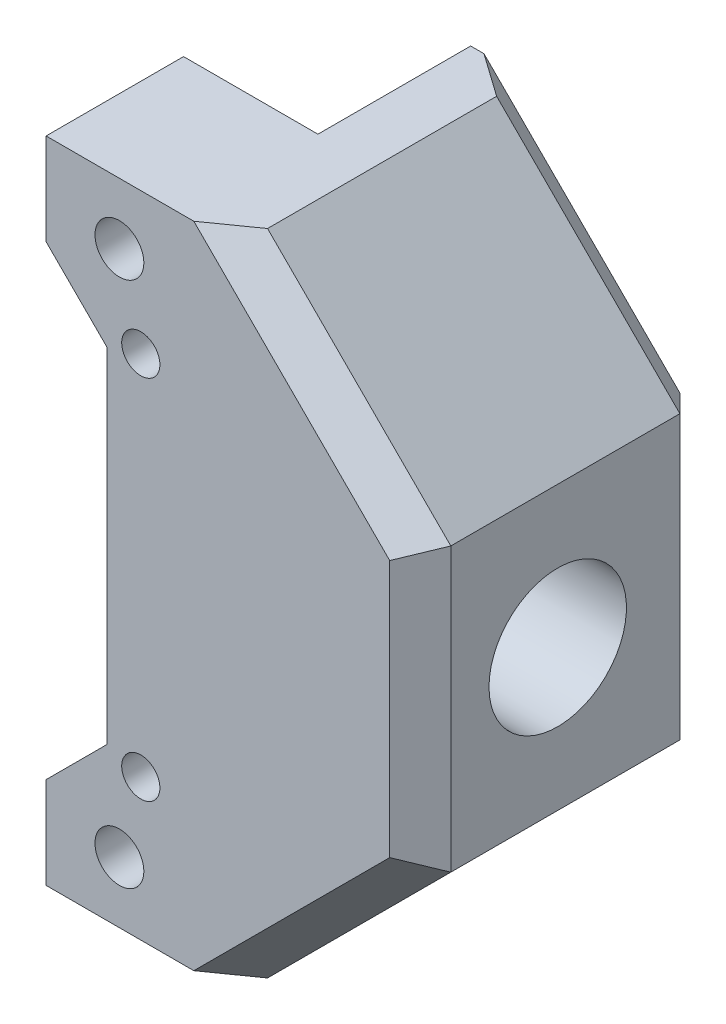
ISO-10303-21;
HEADER;
FILE_DESCRIPTION(('STEP AP214'),'2;1');
FILE_NAME('part.step','',(''),(''),'','','');
FILE_SCHEMA(('AUTOMOTIVE_DESIGN { 1 0 10303 214 1 1 1 1 }'));
ENDSEC;
DATA;
#1=APPLICATION_CONTEXT('core data for automotive mechanical design processes');
#2=APPLICATION_PROTOCOL_DEFINITION('international standard','automotive_design',2000,#1);
#3=PRODUCT_CONTEXT('',#1,'mechanical');
#4=PRODUCT('Part','Part','',(#3));
#5=PRODUCT_RELATED_PRODUCT_CATEGORY('part','',(#4));
#6=PRODUCT_DEFINITION_FORMATION('','',#4);
#7=PRODUCT_DEFINITION_CONTEXT('part definition',#1,'design');
#8=PRODUCT_DEFINITION('design','',#6,#7);
#9=PRODUCT_DEFINITION_SHAPE('','',#8);
#10=(LENGTH_UNIT() NAMED_UNIT(*) SI_UNIT(.MILLI.,.METRE.));
#11=(NAMED_UNIT(*) PLANE_ANGLE_UNIT() SI_UNIT($,.RADIAN.));
#12=(NAMED_UNIT(*) SI_UNIT($,.STERADIAN.) SOLID_ANGLE_UNIT());
#13=UNCERTAINTY_MEASURE_WITH_UNIT(LENGTH_MEASURE(1.E-05),#10,'distance_accuracy_value','');
#14=(GEOMETRIC_REPRESENTATION_CONTEXT(3) GLOBAL_UNCERTAINTY_ASSIGNED_CONTEXT((#13)) GLOBAL_UNIT_ASSIGNED_CONTEXT((#10,
#11,#12)) REPRESENTATION_CONTEXT('',''));
#15=CARTESIAN_POINT('',(0.,0.,0.));
#16=DIRECTION('',(0.,0.,1.));
#17=DIRECTION('',(1.,0.,0.));
#18=AXIS2_PLACEMENT_3D('',#15,#16,#17);
#19=CARTESIAN_POINT('',(38.6154898408302,42.4999999999995,-55.3071738249065));
#20=DIRECTION('',(-1.,0.,0.));
#21=DIRECTION('',(0.,0.,1.));
#22=AXIS2_PLACEMENT_3D('',#19,#20,#21);
#23=PLANE('',#22);
#24=DIRECTION('',(0.,0.,1.));
#25=VECTOR('',#24,1.);
#26=CARTESIAN_POINT('',(38.6154898408302,13.2499999999995,0.));
#27=LINE('',#26,#25);
#28=CARTESIAN_POINT('',(38.6154898408302,13.2499999999995,-10.0000000000035));
#29=VERTEX_POINT('',#28);
#30=CARTESIAN_POINT('',(38.6154898408302,13.2499999999995,0.));
#31=VERTEX_POINT('',#30);
#32=EDGE_CURVE('E256',#29,#31,#27,.T.);
#33=ORIENTED_EDGE('',*,*,#32,.F.);
#34=DIRECTION('',(0.,-1.,0.));
#35=VECTOR('',#34,1.);
#36=CARTESIAN_POINT('',(38.6154898408302,42.4999999999996,-10.0000000000036));
#37=LINE('',#36,#35);
#38=CARTESIAN_POINT('',(38.6154898408302,-5.12577385566101E-13,-10.0000000000035));
#39=VERTEX_POINT('',#38);
#40=EDGE_CURVE('E313',#29,#39,#37,.T.);
#41=ORIENTED_EDGE('',*,*,#40,.T.);
#42=DIRECTION('',(0.,0.,1.));
#43=VECTOR('',#42,1.);
#44=CARTESIAN_POINT('',(38.6154898408302,-5.12577385566101E-13,-55.3071738249065));
#45=LINE('',#44,#43);
#46=CARTESIAN_POINT('',(38.6154898408302,-5.12577385566101E-13,0.));
#47=VERTEX_POINT('',#46);
#48=EDGE_CURVE('E312',#39,#47,#45,.T.);
#49=ORIENTED_EDGE('',*,*,#48,.T.);
#50=DIRECTION('',(0.,1.,0.));
#51=VECTOR('',#50,1.);
#52=CARTESIAN_POINT('',(38.6154898408302,27.2499999999995,0.));
#53=LINE('',#52,#51);
#54=EDGE_CURVE('E382',#47,#31,#53,.T.);
#55=ORIENTED_EDGE('',*,*,#54,.T.);
#56=EDGE_LOOP('',(#33,#41,#49,#55));
#57=FACE_BOUND('',#56,.T.);
#58=ADVANCED_FACE('F39',(#57),#23,.T.);
#59=CARTESIAN_POINT('',(0.,0.,0.));
#60=DIRECTION('',(0.,0.,1.));
#61=DIRECTION('',(1.,0.,0.));
#62=AXIS2_PLACEMENT_3D('',#59,#60,#61);
#63=PLANE('',#62);
#64=CARTESIAN_POINT('',(36.0154898408301,33.2499999999995,0.));
#65=DIRECTION('',(0.,0.,1.));
#66=DIRECTION('',(1.,0.,0.));
#67=AXIS2_PLACEMENT_3D('',#64,#65,#66);
#68=CIRCLE('',#67,1.24999999999999);
#69=CARTESIAN_POINT('',(37.2654898408301,33.2499999999995,0.));
#70=VERTEX_POINT('',#69);
#71=EDGE_CURVE('E926',#70,#70,#68,.T.);
#72=ORIENTED_EDGE('',*,*,#71,.T.);
#73=EDGE_LOOP('',(#72));
#74=FACE_BOUND('',#73,.T.);
#75=CARTESIAN_POINT('',(34.6154898408302,38.4999999999995,0.));
#76=DIRECTION('',(0.,0.,1.));
#77=DIRECTION('',(1.,0.,0.));
#78=AXIS2_PLACEMENT_3D('',#75,#76,#77);
#79=CIRCLE('',#78,1.59999999999999);
#80=CARTESIAN_POINT('',(36.2154898408301,38.4999999999995,0.));
#81=VERTEX_POINT('',#80);
#82=EDGE_CURVE('E327',#81,#81,#79,.T.);
#83=ORIENTED_EDGE('',*,*,#82,.T.);
#84=EDGE_LOOP('',(#83));
#85=FACE_BOUND('',#84,.T.);
#86=CARTESIAN_POINT('',(38.6154898408302,27.2499999999995,0.));
#87=VERTEX_POINT('',#86);
#88=CARTESIAN_POINT('',(38.6154898408302,29.2499999999995,0.));
#89=VERTEX_POINT('',#88);
#90=EDGE_CURVE('E387',#87,#89,#53,.T.);
#91=ORIENTED_EDGE('',*,*,#90,.F.);
#92=DIRECTION('',(-1.,0.,0.));
#93=VECTOR('',#92,1.);
#94=CARTESIAN_POINT('',(55.5860525893073,27.2499999999995,0.));
#95=LINE('',#94,#93);
#96=CARTESIAN_POINT('',(33.8154898408301,27.2499999999995,0.));
#97=VERTEX_POINT('',#96);
#98=EDGE_CURVE('E299',#87,#97,#95,.T.);
#99=ORIENTED_EDGE('',*,*,#98,.T.);
#100=DIRECTION('',(0.,-1.,0.));
#101=VECTOR('',#100,1.);
#102=CARTESIAN_POINT('',(33.8154898408302,15.2499999999995,0.));
#103=LINE('',#102,#101);
#104=CARTESIAN_POINT('',(33.8154898408302,32.4999999999995,0.));
#105=VERTEX_POINT('',#104);
#106=EDGE_CURVE('E349',#105,#97,#103,.T.);
#107=ORIENTED_EDGE('',*,*,#106,.F.);
#108=DIRECTION('',(0.707106781186546,-0.707106781186549,0.));
#109=VECTOR('',#108,1.);
#110=CARTESIAN_POINT('',(29.8154898408302,36.4999999999995,0.));
#111=LINE('',#110,#109);
#112=CARTESIAN_POINT('',(29.8154898408302,36.4999999999995,0.));
#113=VERTEX_POINT('',#112);
#114=EDGE_CURVE('E540',#113,#105,#111,.T.);
#115=ORIENTED_EDGE('',*,*,#114,.F.);
#116=DIRECTION('',(0.,-1.,0.));
#117=VECTOR('',#116,1.);
#118=CARTESIAN_POINT('',(29.8154898408302,42.4999999999995,0.));
#119=LINE('',#118,#117);
#120=CARTESIAN_POINT('',(29.8154898408302,42.4999999999995,0.));
#121=VERTEX_POINT('',#120);
#122=EDGE_CURVE('E377',#121,#113,#119,.T.);
#123=ORIENTED_EDGE('',*,*,#122,.F.);
#124=DIRECTION('',(-1.,0.,0.));
#125=VECTOR('',#124,1.);
#126=CARTESIAN_POINT('',(38.6154898408302,42.4999999999995,0.));
#127=LINE('',#126,#125);
#128=CARTESIAN_POINT('',(38.6154898408302,42.4999999999995,0.));
#129=VERTEX_POINT('',#128);
#130=EDGE_CURVE('E522',#129,#121,#127,.T.);
#131=ORIENTED_EDGE('',*,*,#130,.F.);
#132=EDGE_CURVE('E390',#89,#129,#53,.T.);
#133=ORIENTED_EDGE('',*,*,#132,.F.);
#134=EDGE_LOOP('',(#91,#99,#107,#115,#123,#131,#133));
#135=FACE_BOUND('',#134,.T.);
#136=ADVANCED_FACE('F585',(#74,#85,#135),#63,.F.);
#137=CARTESIAN_POINT('',(0.,0.,9.));
#138=DIRECTION('',(0.,0.,1.));
#139=DIRECTION('',(1.,0.,0.));
#140=AXIS2_PLACEMENT_3D('',#137,#138,#139);
#141=PLANE('',#140);
#142=CARTESIAN_POINT('',(36.0154898408301,33.2499999999995,9.));
#143=DIRECTION('',(0.,0.,1.));
#144=DIRECTION('',(1.,0.,0.));
#145=AXIS2_PLACEMENT_3D('',#142,#143,#144);
#146=CIRCLE('',#145,1.24999999999999);
#147=CARTESIAN_POINT('',(37.2654898408301,33.2499999999995,9.));
#148=VERTEX_POINT('',#147);
#149=EDGE_CURVE('E929',#148,#148,#146,.T.);
#150=ORIENTED_EDGE('',*,*,#149,.F.);
#151=EDGE_LOOP('',(#150));
#152=FACE_BOUND('',#151,.T.);
#153=CARTESIAN_POINT('',(36.0154898408301,9.2499999999995,9.));
#154=DIRECTION('',(0.,0.,1.));
#155=DIRECTION('',(1.,0.,0.));
#156=AXIS2_PLACEMENT_3D('',#153,#154,#155);
#157=CIRCLE('',#156,1.24999999999999);
#158=CARTESIAN_POINT('',(37.2654898408301,9.2499999999995,9.));
#159=VERTEX_POINT('',#158);
#160=EDGE_CURVE('E922',#159,#159,#157,.T.);
#161=ORIENTED_EDGE('',*,*,#160,.F.);
#162=EDGE_LOOP('',(#161));
#163=FACE_BOUND('',#162,.T.);
#164=CARTESIAN_POINT('',(34.6154898408302,3.99999999999949,9.));
#165=DIRECTION('',(0.,0.,1.));
#166=DIRECTION('',(1.,0.,0.));
#167=AXIS2_PLACEMENT_3D('',#164,#165,#166);
#168=CIRCLE('',#167,1.59999999999999);
#169=CARTESIAN_POINT('',(36.2154898408301,3.99999999999949,9.));
#170=VERTEX_POINT('',#169);
#171=EDGE_CURVE('E336',#170,#170,#168,.T.);
#172=ORIENTED_EDGE('',*,*,#171,.F.);
#173=EDGE_LOOP('',(#172));
#174=FACE_BOUND('',#173,.T.);
#175=DIRECTION('',(0.,1.,0.));
#176=VECTOR('',#175,1.);
#177=CARTESIAN_POINT('',(52.3154898408293,0.,9.));
#178=LINE('',#177,#176);
#179=CARTESIAN_POINT('',(52.3154898408293,12.8284271247462,9.));
#180=VERTEX_POINT('',#179);
#181=CARTESIAN_POINT('',(52.3154898408293,29.6715728752533,9.));
#182=VERTEX_POINT('',#181);
#183=EDGE_CURVE('E49',#180,#182,#178,.T.);
#184=ORIENTED_EDGE('',*,*,#183,.T.);
#185=DIRECTION('',(-0.707106781186549,0.707106781186546,0.));
#186=VECTOR('',#185,1.);
#187=CARTESIAN_POINT('',(40.9935313580412,40.9935313580414,9.));
#188=LINE('',#187,#186);
#189=CARTESIAN_POINT('',(39.4870627160831,42.4999999999995,9.));
#190=VERTEX_POINT('',#189);
#191=EDGE_CURVE('E11',#182,#190,#188,.T.);
#192=ORIENTED_EDGE('',*,*,#191,.T.);
#193=DIRECTION('',(-1.,0.,0.));
#194=VECTOR('',#193,1.);
#195=CARTESIAN_POINT('',(38.6154898408302,42.4999999999995,9.));
#196=LINE('',#195,#194);
#197=CARTESIAN_POINT('',(29.8154898408302,42.4999999999995,9.));
#198=VERTEX_POINT('',#197);
#199=EDGE_CURVE('E358',#190,#198,#196,.T.);
#200=ORIENTED_EDGE('',*,*,#199,.T.);
#201=DIRECTION('',(0.,-1.,0.));
#202=VECTOR('',#201,1.);
#203=CARTESIAN_POINT('',(29.8154898408302,42.4999999999995,9.));
#204=LINE('',#203,#202);
#205=CARTESIAN_POINT('',(29.8154898408302,36.4999999999995,9.));
#206=VERTEX_POINT('',#205);
#207=EDGE_CURVE('E361',#198,#206,#204,.T.);
#208=ORIENTED_EDGE('',*,*,#207,.T.);
#209=DIRECTION('',(0.707106781186546,-0.707106781186549,0.));
#210=VECTOR('',#209,1.);
#211=CARTESIAN_POINT('',(29.8154898408302,36.4999999999995,9.));
#212=LINE('',#211,#210);
#213=CARTESIAN_POINT('',(33.8154898408302,32.4999999999995,9.));
#214=VERTEX_POINT('',#213);
#215=EDGE_CURVE('E364',#206,#214,#212,.T.);
#216=ORIENTED_EDGE('',*,*,#215,.T.);
#217=DIRECTION('',(0.,-1.,0.));
#218=VECTOR('',#217,1.);
#219=CARTESIAN_POINT('',(33.8154898408302,15.2499999999995,9.));
#220=LINE('',#219,#218);
#221=CARTESIAN_POINT('',(33.8154898408302,9.99999999999949,9.));
#222=VERTEX_POINT('',#221);
#223=EDGE_CURVE('E344',#214,#222,#220,.T.);
#224=ORIENTED_EDGE('',*,*,#223,.T.);
#225=DIRECTION('',(-0.707106781186548,-0.707106781186547,0.));
#226=VECTOR('',#225,1.);
#227=CARTESIAN_POINT('',(33.8154898408302,9.99999999999949,9.));
#228=LINE('',#227,#226);
#229=CARTESIAN_POINT('',(29.8154898408302,5.99999999999951,9.));
#230=VERTEX_POINT('',#229);
#231=EDGE_CURVE('E348',#222,#230,#228,.T.);
#232=ORIENTED_EDGE('',*,*,#231,.T.);
#233=DIRECTION('',(0.,-1.,0.));
#234=VECTOR('',#233,1.);
#235=CARTESIAN_POINT('',(29.8154898408302,5.99999999999951,9.));
#236=LINE('',#235,#234);
#237=CARTESIAN_POINT('',(29.8154898408302,-5.12595255720009E-13,9.));
#238=VERTEX_POINT('',#237);
#239=EDGE_CURVE('E352',#230,#238,#236,.T.);
#240=ORIENTED_EDGE('',*,*,#239,.T.);
#241=DIRECTION('',(1.,0.,0.));
#242=VECTOR('',#241,1.);
#243=CARTESIAN_POINT('',(29.8154898408302,-5.12595255720009E-13,9.));
#244=LINE('',#243,#242);
#245=CARTESIAN_POINT('',(39.4870627160826,-5.1301351788458E-13,9.));
#246=VERTEX_POINT('',#245);
#247=EDGE_CURVE('E355',#238,#246,#244,.T.);
#248=ORIENTED_EDGE('',*,*,#247,.T.);
#249=DIRECTION('',(0.707106781186546,0.707106781186549,0.));
#250=VECTOR('',#249,1.);
#251=CARTESIAN_POINT('',(19.7435313580417,-19.7435313580416,9.));
#252=LINE('',#251,#250);
#253=EDGE_CURVE('E63',#246,#180,#252,.T.);
#254=ORIENTED_EDGE('',*,*,#253,.T.);
#255=EDGE_LOOP('',(#184,#192,#200,#208,#216,#224,#232,#240,#248,#254));
#256=FACE_BOUND('',#255,.T.);
#257=CARTESIAN_POINT('',(34.6154898408302,38.4999999999995,9.));
#258=DIRECTION('',(0.,0.,1.));
#259=DIRECTION('',(1.,0.,0.));
#260=AXIS2_PLACEMENT_3D('',#257,#258,#259);
#261=CIRCLE('',#260,1.59999999999999);
#262=CARTESIAN_POINT('',(36.2154898408301,38.4999999999995,9.));
#263=VERTEX_POINT('',#262);
#264=EDGE_CURVE('E328',#263,#263,#261,.T.);
#265=ORIENTED_EDGE('',*,*,#264,.F.);
#266=EDGE_LOOP('',(#265));
#267=FACE_BOUND('',#266,.T.);
#268=ADVANCED_FACE('F515',(#152,#163,#174,#256,#267),#141,.T.);
#269=CARTESIAN_POINT('',(36.0154898408301,9.2499999999995,0.));
#270=DIRECTION('',(0.,0.,1.));
#271=DIRECTION('',(1.,0.,0.));
#272=AXIS2_PLACEMENT_3D('',#269,#270,#271);
#273=CIRCLE('',#272,1.24999999999999);
#274=CARTESIAN_POINT('',(37.2654898408301,9.2499999999995,0.));
#275=VERTEX_POINT('',#274);
#276=EDGE_CURVE('E43',#275,#275,#273,.T.);
#277=ORIENTED_EDGE('',*,*,#276,.T.);
#278=EDGE_LOOP('',(#277));
#279=FACE_BOUND('',#278,.T.);
#280=CARTESIAN_POINT('',(34.6154898408302,3.99999999999949,0.));
#281=DIRECTION('',(0.,0.,1.));
#282=DIRECTION('',(1.,0.,0.));
#283=AXIS2_PLACEMENT_3D('',#280,#281,#282);
#284=CIRCLE('',#283,1.59999999999999);
#285=CARTESIAN_POINT('',(36.2154898408301,3.99999999999949,0.));
#286=VERTEX_POINT('',#285);
#287=EDGE_CURVE('E332',#286,#286,#284,.T.);
#288=ORIENTED_EDGE('',*,*,#287,.T.);
#289=EDGE_LOOP('',(#288));
#290=FACE_BOUND('',#289,.T.);
#291=CARTESIAN_POINT('',(33.8154898408302,15.2499999999995,0.));
#292=VERTEX_POINT('',#291);
#293=CARTESIAN_POINT('',(33.8154898408302,9.99999999999949,0.));
#294=VERTEX_POINT('',#293);
#295=EDGE_CURVE('E942',#292,#294,#103,.T.);
#296=ORIENTED_EDGE('',*,*,#295,.F.);
#297=DIRECTION('',(-1.,0.,0.));
#298=VECTOR('',#297,1.);
#299=CARTESIAN_POINT('',(55.5860525893073,15.2499999999995,0.));
#300=LINE('',#299,#298);
#301=CARTESIAN_POINT('',(38.6154898408302,15.2499999999995,0.));
#302=VERTEX_POINT('',#301);
#303=EDGE_CURVE('E295',#292,#302,#300,.F.);
#304=ORIENTED_EDGE('',*,*,#303,.T.);
#305=DIRECTION('',(0.,-1.,0.));
#306=VECTOR('',#305,1.);
#307=CARTESIAN_POINT('',(38.6154898408302,0.,0.));
#308=LINE('',#307,#306);
#309=EDGE_CURVE('E279',#302,#31,#308,.T.);
#310=ORIENTED_EDGE('',*,*,#309,.T.);
#311=ORIENTED_EDGE('',*,*,#54,.F.);
#312=DIRECTION('',(1.,0.,0.));
#313=VECTOR('',#312,1.);
#314=CARTESIAN_POINT('',(29.8154898408302,-5.12595255720009E-13,0.));
#315=LINE('',#314,#313);
#316=CARTESIAN_POINT('',(29.8154898408302,-5.12595255720009E-13,0.));
#317=VERTEX_POINT('',#316);
#318=EDGE_CURVE('E374',#317,#47,#315,.T.);
#319=ORIENTED_EDGE('',*,*,#318,.F.);
#320=DIRECTION('',(0.,-1.,0.));
#321=VECTOR('',#320,1.);
#322=CARTESIAN_POINT('',(29.8154898408302,5.99999999999951,0.));
#323=LINE('',#322,#321);
#324=CARTESIAN_POINT('',(29.8154898408302,5.99999999999951,0.));
#325=VERTEX_POINT('',#324);
#326=EDGE_CURVE('E371',#325,#317,#323,.T.);
#327=ORIENTED_EDGE('',*,*,#326,.F.);
#328=DIRECTION('',(-0.707106781186548,-0.707106781186547,0.));
#329=VECTOR('',#328,1.);
#330=CARTESIAN_POINT('',(33.8154898408302,9.99999999999949,0.));
#331=LINE('',#330,#329);
#332=EDGE_CURVE('E340',#294,#325,#331,.T.);
#333=ORIENTED_EDGE('',*,*,#332,.F.);
#334=EDGE_LOOP('',(#296,#304,#310,#311,#319,#327,#333));
#335=FACE_BOUND('',#334,.T.);
#336=ADVANCED_FACE('F573',(#279,#290,#335),#63,.F.);
#337=CARTESIAN_POINT('',(33.8154898408302,9.99999999999949,9.));
#338=DIRECTION('',(0.707106781186547,-0.707106781186548,0.));
#339=DIRECTION('',(0.707106781186548,0.707106781186547,0.));
#340=AXIS2_PLACEMENT_3D('',#337,#338,#339);
#341=PLANE('',#340);
#342=ORIENTED_EDGE('',*,*,#332,.T.);
#343=DIRECTION('',(0.,0.,-1.));
#344=VECTOR('',#343,1.);
#345=CARTESIAN_POINT('',(29.8154898408302,5.99999999999951,9.));
#346=LINE('',#345,#344);
#347=EDGE_CURVE('E554',#230,#325,#346,.T.);
#348=ORIENTED_EDGE('',*,*,#347,.F.);
#349=ORIENTED_EDGE('',*,*,#231,.F.);
#350=DIRECTION('',(0.,0.,-1.));
#351=VECTOR('',#350,1.);
#352=CARTESIAN_POINT('',(33.8154898408302,9.99999999999949,9.));
#353=LINE('',#352,#351);
#354=EDGE_CURVE('E399',#222,#294,#353,.T.);
#355=ORIENTED_EDGE('',*,*,#354,.T.);
#356=EDGE_LOOP('',(#342,#348,#349,#355));
#357=FACE_BOUND('',#356,.T.);
#358=ADVANCED_FACE('F614',(#357),#341,.F.);
#359=CARTESIAN_POINT('',(29.8154898408302,5.99999999999951,9.));
#360=DIRECTION('',(1.,0.,0.));
#361=DIRECTION('',(0.,1.,0.));
#362=AXIS2_PLACEMENT_3D('',#359,#360,#361);
#363=PLANE('',#362);
#364=ORIENTED_EDGE('',*,*,#326,.T.);
#365=DIRECTION('',(0.,0.,-1.));
#366=VECTOR('',#365,1.);
#367=CARTESIAN_POINT('',(29.8154898408302,-5.12595255720009E-13,9.));
#368=LINE('',#367,#366);
#369=EDGE_CURVE('E526',#238,#317,#368,.T.);
#370=ORIENTED_EDGE('',*,*,#369,.F.);
#371=ORIENTED_EDGE('',*,*,#239,.F.);
#372=ORIENTED_EDGE('',*,*,#347,.T.);
#373=EDGE_LOOP('',(#364,#370,#371,#372));
#374=FACE_BOUND('',#373,.T.);
#375=ADVANCED_FACE('F619',(#374),#363,.F.);
#376=CARTESIAN_POINT('',(29.8154898408302,-5.12595255720009E-13,9.));
#377=DIRECTION('',(0.,1.,0.));
#378=DIRECTION('',(-1.,0.,0.));
#379=AXIS2_PLACEMENT_3D('',#376,#377,#378);
#380=PLANE('',#379);
#381=DIRECTION('',(1.,0.,0.));
#382=VECTOR('',#381,1.);
#383=CARTESIAN_POINT('',(38.6154898408301,-5.12577385566102E-13,-10.0000000000035));
#384=LINE('',#383,#382);
#385=CARTESIAN_POINT('',(39.4870627160826,-4.98366976807623E-13,-10.0000000000035));
#386=VERTEX_POINT('',#385);
#387=EDGE_CURVE('E303',#39,#386,#384,.T.);
#388=ORIENTED_EDGE('',*,*,#387,.T.);
#389=DIRECTION('',(-0.816496580927724,0.,-0.577350269189628));
#390=VECTOR('',#389,1.);
#391=CARTESIAN_POINT('',(40.0298717361504,-5.12610787151146E-13,-9.61617606102427));
#392=LINE('',#391,#390);
#393=CARTESIAN_POINT('',(42.3154898408288,-5.12569871978662E-13,-8.00000000000345));
#394=VERTEX_POINT('',#393);
#395=EDGE_CURVE('E441',#386,#394,#392,.F.);
#396=ORIENTED_EDGE('',*,*,#395,.T.);
#397=DIRECTION('',(0.,0.,1.));
#398=VECTOR('',#397,1.);
#399=CARTESIAN_POINT('',(42.3154898408288,-5.12569871978662E-13,9.));
#400=LINE('',#399,#398);
#401=CARTESIAN_POINT('',(42.3154898408288,-5.13007774199576E-13,6.99999999999999));
#402=VERTEX_POINT('',#401);
#403=EDGE_CURVE('E407',#394,#402,#400,.T.);
#404=ORIENTED_EDGE('',*,*,#403,.T.);
#405=DIRECTION('',(0.816496580927723,0.,-0.577350269189631));
#406=VECTOR('',#405,1.);
#407=CARTESIAN_POINT('',(26.3247084773888,-5.13478148889135E-13,18.3071899385601));
#408=LINE('',#407,#406);
#409=EDGE_CURVE('E438',#402,#246,#408,.F.);
#410=ORIENTED_EDGE('',*,*,#409,.T.);
#411=ORIENTED_EDGE('',*,*,#247,.F.);
#412=ORIENTED_EDGE('',*,*,#369,.T.);
#413=ORIENTED_EDGE('',*,*,#318,.T.);
#414=ORIENTED_EDGE('',*,*,#48,.F.);
#415=EDGE_LOOP('',(#388,#396,#404,#410,#411,#412,#413,#414));
#416=FACE_BOUND('',#415,.T.);
#417=ADVANCED_FACE('F478',(#416),#380,.F.);
#418=CARTESIAN_POINT('',(38.6154898408302,42.4999999999995,9.));
#419=DIRECTION('',(0.,-1.,0.));
#420=DIRECTION('',(0.,0.,-1.));
#421=AXIS2_PLACEMENT_3D('',#418,#419,#420);
#422=PLANE('',#421);
#423=DIRECTION('',(0.,0.,-1.));
#424=VECTOR('',#423,1.);
#425=CARTESIAN_POINT('',(42.3154898408293,42.4999999999995,-10.0000000000035));
#426=LINE('',#425,#424);
#427=CARTESIAN_POINT('',(42.3154898408293,42.4999999999995,6.99999999999999));
#428=VERTEX_POINT('',#427);
#429=CARTESIAN_POINT('',(42.3154898408293,42.4999999999995,-8.00000000000353));
#430=VERTEX_POINT('',#429);
#431=EDGE_CURVE('E403',#428,#430,#426,.T.);
#432=ORIENTED_EDGE('',*,*,#431,.T.);
#433=DIRECTION('',(0.816496580927726,0.,0.577350269189626));
#434=VECTOR('',#433,1.);
#435=CARTESIAN_POINT('',(25.8632050911543,42.4999999999995,-19.6335221125107));
#436=LINE('',#435,#434);
#437=CARTESIAN_POINT('',(39.4870627160831,42.4999999999995,-10.0000000000035));
#438=VERTEX_POINT('',#437);
#439=EDGE_CURVE('E429',#430,#438,#436,.F.);
#440=ORIENTED_EDGE('',*,*,#439,.T.);
#441=DIRECTION('',(-1.,0.,0.));
#442=VECTOR('',#441,1.);
#443=CARTESIAN_POINT('',(54.3154898408293,42.4999999999995,-10.0000000000035));
#444=LINE('',#443,#442);
#445=CARTESIAN_POINT('',(38.6154898408302,42.4999999999995,-10.0000000000035));
#446=VERTEX_POINT('',#445);
#447=EDGE_CURVE('E307',#438,#446,#444,.T.);
#448=ORIENTED_EDGE('',*,*,#447,.T.);
#449=DIRECTION('',(0.,0.,1.));
#450=VECTOR('',#449,1.);
#451=CARTESIAN_POINT('',(38.6154898408302,42.4999999999995,-55.3071738249065));
#452=LINE('',#451,#450);
#453=EDGE_CURVE('E316',#446,#129,#452,.T.);
#454=ORIENTED_EDGE('',*,*,#453,.T.);
#455=ORIENTED_EDGE('',*,*,#130,.T.);
#456=DIRECTION('',(0.,0.,-1.));
#457=VECTOR('',#456,1.);
#458=CARTESIAN_POINT('',(29.8154898408302,42.4999999999995,9.));
#459=LINE('',#458,#457);
#460=EDGE_CURVE('E519',#198,#121,#459,.T.);
#461=ORIENTED_EDGE('',*,*,#460,.F.);
#462=ORIENTED_EDGE('',*,*,#199,.F.);
#463=DIRECTION('',(-0.816496580927726,0.,0.577350269189626));
#464=VECTOR('',#463,1.);
#465=CARTESIAN_POINT('',(40.4913751440552,42.4999999999995,8.289843871751));
#466=LINE('',#465,#464);
#467=EDGE_CURVE('E426',#190,#428,#466,.F.);
#468=ORIENTED_EDGE('',*,*,#467,.T.);
#469=EDGE_LOOP('',(#432,#440,#448,#454,#455,#461,#462,#468));
#470=FACE_BOUND('',#469,.T.);
#471=ADVANCED_FACE('F510',(#470),#422,.F.);
#472=CARTESIAN_POINT('',(29.8154898408302,42.4999999999995,9.));
#473=DIRECTION('',(1.,0.,0.));
#474=DIRECTION('',(0.,0.,-1.));
#475=AXIS2_PLACEMENT_3D('',#472,#473,#474);
#476=PLANE('',#475);
#477=ORIENTED_EDGE('',*,*,#122,.T.);
#478=DIRECTION('',(0.,0.,-1.));
#479=VECTOR('',#478,1.);
#480=CARTESIAN_POINT('',(29.8154898408302,36.4999999999995,9.));
#481=LINE('',#480,#479);
#482=EDGE_CURVE('E527',#206,#113,#481,.T.);
#483=ORIENTED_EDGE('',*,*,#482,.F.);
#484=ORIENTED_EDGE('',*,*,#207,.F.);
#485=ORIENTED_EDGE('',*,*,#460,.T.);
#486=EDGE_LOOP('',(#477,#483,#484,#485));
#487=FACE_BOUND('',#486,.T.);
#488=ADVANCED_FACE('F530',(#487),#476,.F.);
#489=CARTESIAN_POINT('',(29.8154898408302,36.4999999999995,9.));
#490=DIRECTION('',(0.707106781186549,0.707106781186546,0.));
#491=DIRECTION('',(-0.707106781186546,0.707106781186549,0.));
#492=AXIS2_PLACEMENT_3D('',#489,#490,#491);
#493=PLANE('',#492);
#494=ORIENTED_EDGE('',*,*,#114,.T.);
#495=DIRECTION('',(0.,0.,-1.));
#496=VECTOR('',#495,1.);
#497=CARTESIAN_POINT('',(33.8154898408302,32.4999999999995,9.));
#498=LINE('',#497,#496);
#499=EDGE_CURVE('E368',#214,#105,#498,.T.);
#500=ORIENTED_EDGE('',*,*,#499,.F.);
#501=ORIENTED_EDGE('',*,*,#215,.F.);
#502=ORIENTED_EDGE('',*,*,#482,.T.);
#503=EDGE_LOOP('',(#494,#500,#501,#502));
#504=FACE_BOUND('',#503,.T.);
#505=ADVANCED_FACE('F538',(#504),#493,.F.);
#506=CARTESIAN_POINT('',(33.8154898408302,15.2499999999995,9.));
#507=DIRECTION('',(1.,0.,0.));
#508=DIRECTION('',(0.,1.,0.));
#509=AXIS2_PLACEMENT_3D('',#506,#507,#508);
#510=PLANE('',#509);
#511=ORIENTED_EDGE('',*,*,#106,.T.);
#512=CARTESIAN_POINT('',(33.8154898408301,21.2499999999995,0.));
#513=DIRECTION('',(-1.,0.,0.));
#514=DIRECTION('',(0.,-1.,0.));
#515=AXIS2_PLACEMENT_3D('',#512,#513,#514);
#516=CIRCLE('',#515,6.);
#517=EDGE_CURVE('E288',#292,#97,#516,.T.);
#518=ORIENTED_EDGE('',*,*,#517,.F.);
#519=ORIENTED_EDGE('',*,*,#295,.T.);
#520=ORIENTED_EDGE('',*,*,#354,.F.);
#521=ORIENTED_EDGE('',*,*,#223,.F.);
#522=ORIENTED_EDGE('',*,*,#499,.T.);
#523=EDGE_LOOP('',(#511,#518,#519,#520,#521,#522));
#524=FACE_BOUND('',#523,.T.);
#525=ADVANCED_FACE('F630',(#524),#510,.F.);
#526=CARTESIAN_POINT('',(34.6154898408302,3.99999999999949,9.));
#527=DIRECTION('',(0.,0.,-1.));
#528=DIRECTION('',(-1.,0.,0.));
#529=AXIS2_PLACEMENT_3D('',#526,#527,#528);
#530=CYLINDRICAL_SURFACE('',#529,1.59999999999999);
#531=ORIENTED_EDGE('',*,*,#171,.T.);
#532=EDGE_LOOP('',(#531));
#533=FACE_BOUND('',#532,.T.);
#534=ORIENTED_EDGE('',*,*,#287,.F.);
#535=EDGE_LOOP('',(#534));
#536=FACE_BOUND('',#535,.T.);
#537=ADVANCED_FACE('F627',(#533,#536),#530,.F.);
#538=CARTESIAN_POINT('',(34.6154898408302,38.4999999999995,9.));
#539=DIRECTION('',(0.,0.,-1.));
#540=DIRECTION('',(-1.,0.,0.));
#541=AXIS2_PLACEMENT_3D('',#538,#539,#540);
#542=CYLINDRICAL_SURFACE('',#541,1.59999999999999);
#543=ORIENTED_EDGE('',*,*,#264,.T.);
#544=EDGE_LOOP('',(#543));
#545=FACE_BOUND('',#544,.T.);
#546=ORIENTED_EDGE('',*,*,#82,.F.);
#547=EDGE_LOOP('',(#546));
#548=FACE_BOUND('',#547,.T.);
#549=ADVANCED_FACE('F629',(#545,#548),#542,.F.);
#550=CARTESIAN_POINT('',(-1.38451019120854,42.499999967494,-10.0000000000036));
#551=DIRECTION('',(0.,0.,-1.));
#552=DIRECTION('',(0.,1.,0.));
#553=AXIS2_PLACEMENT_3D('',#550,#551,#552);
#554=PLANE('',#553);
#555=ORIENTED_EDGE('',*,*,#447,.F.);
#556=DIRECTION('',(0.707106781186549,-0.707106781186546,0.));
#557=VECTOR('',#556,1.);
#558=CARTESIAN_POINT('',(19.05127627869,62.9357864373926,-10.0000000000036));
#559=LINE('',#558,#557);
#560=CARTESIAN_POINT('',(52.3154898408293,29.6715728752533,-10.0000000000035));
#561=VERTEX_POINT('',#560);
#562=EDGE_CURVE('E417',#438,#561,#559,.T.);
#563=ORIENTED_EDGE('',*,*,#562,.T.);
#564=DIRECTION('',(0.,-1.,0.));
#565=VECTOR('',#564,1.);
#566=CARTESIAN_POINT('',(52.3154898408293,42.499999967494,-10.0000000000035));
#567=LINE('',#566,#565);
#568=CARTESIAN_POINT('',(52.3154898408293,12.8284271247462,-10.0000000000035));
#569=VERTEX_POINT('',#568);
#570=EDGE_CURVE('E414',#561,#569,#567,.T.);
#571=ORIENTED_EDGE('',*,*,#570,.T.);
#572=DIRECTION('',(-0.707106781186546,-0.707106781186549,0.));
#573=VECTOR('',#572,1.);
#574=CARTESIAN_POINT('',(40.3012762461844,0.814213530101242,-10.0000000000035));
#575=LINE('',#574,#573);
#576=EDGE_CURVE('E411',#569,#386,#575,.T.);
#577=ORIENTED_EDGE('',*,*,#576,.T.);
#578=ORIENTED_EDGE('',*,*,#387,.F.);
#579=ORIENTED_EDGE('',*,*,#40,.F.);
#580=DIRECTION('',(-1.,0.,0.));
#581=VECTOR('',#580,1.);
#582=CARTESIAN_POINT('',(43.6154898408302,13.2499999999995,-10.0000000000035));
#583=LINE('',#582,#581);
#584=CARTESIAN_POINT('',(43.6154898408302,13.2499999999995,-10.0000000000035));
#585=VERTEX_POINT('',#584);
#586=EDGE_CURVE('E280',#585,#29,#583,.T.);
#587=ORIENTED_EDGE('',*,*,#586,.F.);
#588=DIRECTION('',(0.,-1.,0.));
#589=VECTOR('',#588,1.);
#590=CARTESIAN_POINT('',(43.6154898408302,13.2499999999995,-10.0000000000035));
#591=LINE('',#590,#589);
#592=CARTESIAN_POINT('',(43.6154898408302,29.2499999999995,-10.0000000000035));
#593=VERTEX_POINT('',#592);
#594=EDGE_CURVE('E251',#593,#585,#591,.T.);
#595=ORIENTED_EDGE('',*,*,#594,.F.);
#596=DIRECTION('',(-1.,0.,0.));
#597=VECTOR('',#596,1.);
#598=CARTESIAN_POINT('',(43.6154898408302,29.2499999999995,-10.0000000000035));
#599=LINE('',#598,#597);
#600=CARTESIAN_POINT('',(38.6154898408302,29.2499999999995,-10.0000000000035));
#601=VERTEX_POINT('',#600);
#602=EDGE_CURVE('E241',#593,#601,#599,.T.);
#603=ORIENTED_EDGE('',*,*,#602,.T.);
#604=EDGE_CURVE('E308',#446,#601,#37,.T.);
#605=ORIENTED_EDGE('',*,*,#604,.F.);
#606=EDGE_LOOP('',(#555,#563,#571,#577,#578,#579,#587,#595,#603,#605));
#607=FACE_BOUND('',#606,.T.);
#608=ADVANCED_FACE('F506',(#607),#554,.T.);
#609=CARTESIAN_POINT('',(54.3154898408293,0.,-55.3071738249065));
#610=DIRECTION('',(1.,0.,0.));
#611=DIRECTION('',(0.,0.,-1.));
#612=AXIS2_PLACEMENT_3D('',#609,#610,#611);
#613=PLANE('',#612);
#614=CARTESIAN_POINT('',(54.3154898408293,21.2499999999995,0.));
#615=DIRECTION('',(-1.,0.,0.));
#616=DIRECTION('',(0.,0.,1.));
#617=AXIS2_PLACEMENT_3D('',#614,#615,#616);
#618=CIRCLE('',#617,4.5);
#619=CARTESIAN_POINT('',(54.3154898408293,21.2499999999995,4.5));
#620=VERTEX_POINT('',#619);
#621=EDGE_CURVE('E274',#620,#620,#618,.T.);
#622=ORIENTED_EDGE('',*,*,#621,.T.);
#623=EDGE_LOOP('',(#622));
#624=FACE_BOUND('',#623,.T.);
#625=DIRECTION('',(0.,0.,-1.));
#626=VECTOR('',#625,1.);
#627=CARTESIAN_POINT('',(54.3154898408293,12.,-10.0000000000035));
#628=LINE('',#627,#626);
#629=CARTESIAN_POINT('',(54.3154898408293,12.,6.99999999999999));
#630=VERTEX_POINT('',#629);
#631=CARTESIAN_POINT('',(54.3154898408293,12.,-8.00000000000346));
#632=VERTEX_POINT('',#631);
#633=EDGE_CURVE('E394',#630,#632,#628,.T.);
#634=ORIENTED_EDGE('',*,*,#633,.T.);
#635=DIRECTION('',(0.,1.,0.));
#636=VECTOR('',#635,1.);
#637=CARTESIAN_POINT('',(54.3154898408293,0.,-8.00000000000344));
#638=LINE('',#637,#636);
#639=CARTESIAN_POINT('',(54.3154898408293,30.4999999999995,-8.0000000000035));
#640=VERTEX_POINT('',#639);
#641=EDGE_CURVE('E435',#632,#640,#638,.T.);
#642=ORIENTED_EDGE('',*,*,#641,.T.);
#643=DIRECTION('',(0.,0.,1.));
#644=VECTOR('',#643,1.);
#645=CARTESIAN_POINT('',(54.3154898408293,30.4999999999995,9.));
#646=LINE('',#645,#644);
#647=CARTESIAN_POINT('',(54.3154898408293,30.4999999999995,6.99999999999999));
#648=VERTEX_POINT('',#647);
#649=EDGE_CURVE('E398',#640,#648,#646,.T.);
#650=ORIENTED_EDGE('',*,*,#649,.T.);
#651=DIRECTION('',(0.,-1.,0.));
#652=VECTOR('',#651,1.);
#653=CARTESIAN_POINT('',(54.3154898408293,0.,6.99999999999999));
#654=LINE('',#653,#652);
#655=EDGE_CURVE('E432',#648,#630,#654,.T.);
#656=ORIENTED_EDGE('',*,*,#655,.T.);
#657=EDGE_LOOP('',(#634,#642,#650,#656));
#658=FACE_BOUND('',#657,.T.);
#659=ADVANCED_FACE('F489',(#624,#658),#613,.T.);
#660=DIRECTION('',(0.,0.,-1.));
#661=VECTOR('',#660,1.);
#662=CARTESIAN_POINT('',(38.6154898408302,29.2499999999995,0.));
#663=LINE('',#662,#661);
#664=EDGE_CURVE('E262',#89,#601,#663,.T.);
#665=ORIENTED_EDGE('',*,*,#664,.F.);
#666=ORIENTED_EDGE('',*,*,#132,.T.);
#667=ORIENTED_EDGE('',*,*,#453,.F.);
#668=ORIENTED_EDGE('',*,*,#604,.T.);
#669=EDGE_LOOP('',(#665,#666,#667,#668));
#670=FACE_BOUND('',#669,.T.);
#671=ADVANCED_FACE('F587',(#670),#23,.T.);
#672=CARTESIAN_POINT('',(55.5860525893073,21.2499999999995,0.));
#673=DIRECTION('',(-1.,0.,0.));
#674=DIRECTION('',(0.,-1.,0.));
#675=AXIS2_PLACEMENT_3D('',#672,#673,#674);
#676=CYLINDRICAL_SURFACE('',#675,6.);
#677=CARTESIAN_POINT('',(38.6154898408302,21.2499999999995,0.));
#678=DIRECTION('',(-1.,0.,0.));
#679=DIRECTION('',(0.,0.,1.));
#680=AXIS2_PLACEMENT_3D('',#677,#678,#679);
#681=CIRCLE('',#680,6.);
#682=EDGE_CURVE('E291',#87,#302,#681,.F.);
#683=ORIENTED_EDGE('',*,*,#682,.T.);
#684=ORIENTED_EDGE('',*,*,#303,.F.);
#685=ORIENTED_EDGE('',*,*,#517,.T.);
#686=ORIENTED_EDGE('',*,*,#98,.F.);
#687=EDGE_LOOP('',(#683,#684,#685,#686));
#688=FACE_BOUND('',#687,.T.);
#689=ADVANCED_FACE('F589',(#688),#676,.F.);
#690=CARTESIAN_POINT('',(38.6154898408302,21.2499999999995,0.));
#691=DIRECTION('',(-1.,0.,0.));
#692=DIRECTION('',(0.,0.,1.));
#693=AXIS2_PLACEMENT_3D('',#690,#691,#692);
#694=PLANE('',#693);
#695=CARTESIAN_POINT('',(38.6154898408302,21.2499999999995,0.));
#696=DIRECTION('',(-1.,0.,0.));
#697=DIRECTION('',(0.,0.,1.));
#698=AXIS2_PLACEMENT_3D('',#695,#696,#697);
#699=CIRCLE('',#698,8.);
#700=EDGE_CURVE('E237',#31,#89,#699,.T.);
#701=ORIENTED_EDGE('',*,*,#700,.F.);
#702=ORIENTED_EDGE('',*,*,#309,.F.);
#703=ORIENTED_EDGE('',*,*,#682,.F.);
#704=ORIENTED_EDGE('',*,*,#90,.T.);
#705=EDGE_LOOP('',(#701,#702,#703,#704));
#706=FACE_BOUND('',#705,.T.);
#707=ADVANCED_FACE('F580',(#706),#694,.F.);
#708=CARTESIAN_POINT('',(43.6154898408302,21.2499999999995,0.));
#709=DIRECTION('',(-1.,0.,0.));
#710=DIRECTION('',(0.,0.,1.));
#711=AXIS2_PLACEMENT_3D('',#708,#709,#710);
#712=CYLINDRICAL_SURFACE('',#711,8.);
#713=ORIENTED_EDGE('',*,*,#700,.T.);
#714=DIRECTION('',(-1.,0.,0.));
#715=VECTOR('',#714,1.);
#716=CARTESIAN_POINT('',(43.6154898408302,29.2499999999995,0.));
#717=LINE('',#716,#715);
#718=CARTESIAN_POINT('',(43.6154898408302,29.2499999999995,0.));
#719=VERTEX_POINT('',#718);
#720=EDGE_CURVE('E230',#719,#89,#717,.T.);
#721=ORIENTED_EDGE('',*,*,#720,.F.);
#722=CARTESIAN_POINT('',(43.6154898408302,21.2499999999995,0.));
#723=DIRECTION('',(-1.,0.,0.));
#724=DIRECTION('',(0.,0.,1.));
#725=AXIS2_PLACEMENT_3D('',#722,#723,#724);
#726=CIRCLE('',#725,8.);
#727=CARTESIAN_POINT('',(43.6154898408302,13.2499999999995,0.));
#728=VERTEX_POINT('',#727);
#729=EDGE_CURVE('E234',#728,#719,#726,.T.);
#730=ORIENTED_EDGE('',*,*,#729,.F.);
#731=DIRECTION('',(-1.,0.,0.));
#732=VECTOR('',#731,1.);
#733=CARTESIAN_POINT('',(43.6154898408302,13.2499999999995,0.));
#734=LINE('',#733,#732);
#735=EDGE_CURVE('E277',#728,#31,#734,.T.);
#736=ORIENTED_EDGE('',*,*,#735,.T.);
#737=EDGE_LOOP('',(#713,#721,#730,#736));
#738=FACE_BOUND('',#737,.T.);
#739=ADVANCED_FACE('F232',(#738),#712,.F.);
#740=CARTESIAN_POINT('',(43.6154898408302,13.2499999999995,0.));
#741=DIRECTION('',(0.,-1.,0.));
#742=DIRECTION('',(0.,0.,-1.));
#743=AXIS2_PLACEMENT_3D('',#740,#741,#742);
#744=PLANE('',#743);
#745=ORIENTED_EDGE('',*,*,#32,.T.);
#746=ORIENTED_EDGE('',*,*,#735,.F.);
#747=DIRECTION('',(0.,0.,1.));
#748=VECTOR('',#747,1.);
#749=CARTESIAN_POINT('',(43.6154898408302,13.2499999999995,0.));
#750=LINE('',#749,#748);
#751=EDGE_CURVE('E242',#585,#728,#750,.T.);
#752=ORIENTED_EDGE('',*,*,#751,.F.);
#753=ORIENTED_EDGE('',*,*,#586,.T.);
#754=EDGE_LOOP('',(#745,#746,#752,#753));
#755=FACE_BOUND('',#754,.T.);
#756=ADVANCED_FACE('F578',(#755),#744,.F.);
#757=CARTESIAN_POINT('',(43.6154898408302,29.2499999999995,0.));
#758=DIRECTION('',(0.,1.,0.));
#759=DIRECTION('',(0.,0.,1.));
#760=AXIS2_PLACEMENT_3D('',#757,#758,#759);
#761=PLANE('',#760);
#762=ORIENTED_EDGE('',*,*,#664,.T.);
#763=ORIENTED_EDGE('',*,*,#602,.F.);
#764=DIRECTION('',(0.,0.,-1.));
#765=VECTOR('',#764,1.);
#766=CARTESIAN_POINT('',(43.6154898408302,29.2499999999995,0.));
#767=LINE('',#766,#765);
#768=EDGE_CURVE('E245',#719,#593,#767,.T.);
#769=ORIENTED_EDGE('',*,*,#768,.F.);
#770=ORIENTED_EDGE('',*,*,#720,.T.);
#771=EDGE_LOOP('',(#762,#763,#769,#770));
#772=FACE_BOUND('',#771,.T.);
#773=ADVANCED_FACE('F246',(#772),#761,.F.);
#774=CARTESIAN_POINT('',(43.6154898408302,21.2499999999995,0.));
#775=DIRECTION('',(-1.,0.,0.));
#776=DIRECTION('',(0.,0.,1.));
#777=AXIS2_PLACEMENT_3D('',#774,#775,#776);
#778=PLANE('',#777);
#779=CARTESIAN_POINT('',(43.6154898408302,21.2499999999995,0.));
#780=DIRECTION('',(-1.,0.,0.));
#781=DIRECTION('',(0.,0.,1.));
#782=AXIS2_PLACEMENT_3D('',#779,#780,#781);
#783=CIRCLE('',#782,4.5);
#784=CARTESIAN_POINT('',(43.6154898408302,21.2499999999995,4.5));
#785=VERTEX_POINT('',#784);
#786=EDGE_CURVE('E265',#785,#785,#783,.T.);
#787=ORIENTED_EDGE('',*,*,#786,.F.);
#788=EDGE_LOOP('',(#787));
#789=FACE_BOUND('',#788,.T.);
#790=ORIENTED_EDGE('',*,*,#729,.T.);
#791=ORIENTED_EDGE('',*,*,#768,.T.);
#792=ORIENTED_EDGE('',*,*,#594,.T.);
#793=ORIENTED_EDGE('',*,*,#751,.T.);
#794=EDGE_LOOP('',(#790,#791,#792,#793));
#795=FACE_BOUND('',#794,.T.);
#796=ADVANCED_FACE('F253',(#789,#795),#778,.T.);
#797=CARTESIAN_POINT('',(54.3154898408293,21.2499999999995,0.));
#798=DIRECTION('',(-1.,0.,0.));
#799=DIRECTION('',(0.,0.,1.));
#800=AXIS2_PLACEMENT_3D('',#797,#798,#799);
#801=CYLINDRICAL_SURFACE('',#800,4.5);
#802=ORIENTED_EDGE('',*,*,#621,.F.);
#803=EDGE_LOOP('',(#802));
#804=FACE_BOUND('',#803,.T.);
#805=ORIENTED_EDGE('',*,*,#786,.T.);
#806=EDGE_LOOP('',(#805));
#807=FACE_BOUND('',#806,.T.);
#808=ADVANCED_FACE('F664',(#804,#807),#801,.F.);
#809=CARTESIAN_POINT('',(54.3154898408293,30.4999999999995,-55.3071738249065));
#810=DIRECTION('',(0.707106781186546,0.707106781186549,0.));
#811=DIRECTION('',(0.,0.,-1.));
#812=AXIS2_PLACEMENT_3D('',#809,#810,#811);
#813=PLANE('',#812);
#814=ORIENTED_EDGE('',*,*,#649,.F.);
#815=DIRECTION('',(-0.707106781186549,0.707106781186546,0.));
#816=VECTOR('',#815,1.);
#817=CARTESIAN_POINT('',(54.3154898408293,30.4999999999996,-8.0000000000035));
#818=LINE('',#817,#816);
#819=EDGE_CURVE('E423',#640,#430,#818,.T.);
#820=ORIENTED_EDGE('',*,*,#819,.T.);
#821=ORIENTED_EDGE('',*,*,#431,.F.);
#822=DIRECTION('',(0.707106781186549,-0.707106781186546,0.));
#823=VECTOR('',#822,1.);
#824=CARTESIAN_POINT('',(54.3154898408293,30.4999999999995,6.99999999999999));
#825=LINE('',#824,#823);
#826=EDGE_CURVE('E421',#428,#648,#825,.T.);
#827=ORIENTED_EDGE('',*,*,#826,.T.);
#828=EDGE_LOOP('',(#814,#820,#821,#827));
#829=FACE_BOUND('',#828,.T.);
#830=ADVANCED_FACE('F493',(#829),#813,.T.);
#831=CARTESIAN_POINT('',(42.3154898408288,-5.12569871978662E-13,9.));
#832=DIRECTION('',(0.707106781186549,-0.707106781186546,0.));
#833=DIRECTION('',(0.,0.,-1.));
#834=AXIS2_PLACEMENT_3D('',#831,#832,#833);
#835=PLANE('',#834);
#836=ORIENTED_EDGE('',*,*,#403,.F.);
#837=DIRECTION('',(0.707106781186546,0.707106781186549,0.));
#838=VECTOR('',#837,1.);
#839=CARTESIAN_POINT('',(42.3154898408288,-5.21930381048106E-13,-8.00000000000345));
#840=LINE('',#839,#838);
#841=EDGE_CURVE('E447',#394,#632,#840,.T.);
#842=ORIENTED_EDGE('',*,*,#841,.T.);
#843=ORIENTED_EDGE('',*,*,#633,.F.);
#844=DIRECTION('',(-0.707106781186546,-0.707106781186549,0.));
#845=VECTOR('',#844,1.);
#846=CARTESIAN_POINT('',(42.3154898408288,-5.12569871978662E-13,6.99999999999999));
#847=LINE('',#846,#845);
#848=EDGE_CURVE('E444',#630,#402,#847,.T.);
#849=ORIENTED_EDGE('',*,*,#848,.T.);
#850=EDGE_LOOP('',(#836,#842,#843,#849));
#851=FACE_BOUND('',#850,.T.);
#852=ADVANCED_FACE('F475',(#851),#835,.T.);
#853=CARTESIAN_POINT('',(40.3012762461844,0.814213530101242,-10.0000000000035));
#854=DIRECTION('',(-0.500000000000002,0.500000000000001,0.707106781186546));
#855=DIRECTION('',(-0.707106781186546,-0.707106781186549,0.));
#856=AXIS2_PLACEMENT_3D('',#853,#854,#855);
#857=PLANE('',#856);
#858=ORIENTED_EDGE('',*,*,#395,.F.);
#859=ORIENTED_EDGE('',*,*,#576,.F.);
#860=DIRECTION('',(0.678598344545845,-0.28108463771482,0.678598344545849));
#861=VECTOR('',#860,1.);
#862=CARTESIAN_POINT('',(49.0746299725308,14.1708352359462,-13.240859868302));
#863=LINE('',#862,#861);
#864=EDGE_CURVE('E457',#632,#569,#863,.F.);
#865=ORIENTED_EDGE('',*,*,#864,.F.);
#866=ORIENTED_EDGE('',*,*,#841,.F.);
#867=EDGE_LOOP('',(#858,#859,#865,#866));
#868=FACE_BOUND('',#867,.T.);
#869=ADVANCED_FACE('F485',(#868),#857,.F.);
#870=CARTESIAN_POINT('',(54.3154898408293,0.,-8.00000000000344));
#871=DIRECTION('',(-0.707106781186549,0.,0.707106781186546));
#872=DIRECTION('',(0.,1.,0.));
#873=AXIS2_PLACEMENT_3D('',#870,#871,#872);
#874=PLANE('',#873);
#875=ORIENTED_EDGE('',*,*,#864,.T.);
#876=ORIENTED_EDGE('',*,*,#570,.F.);
#877=DIRECTION('',(0.678598344545845,0.281084637714824,0.678598344545848));
#878=VECTOR('',#877,1.);
#879=CARTESIAN_POINT('',(48.4978109609978,28.0902385064417,-13.8176788798351));
#880=LINE('',#879,#878);
#881=EDGE_CURVE('E454',#640,#561,#880,.F.);
#882=ORIENTED_EDGE('',*,*,#881,.F.);
#883=ORIENTED_EDGE('',*,*,#641,.F.);
#884=EDGE_LOOP('',(#875,#876,#882,#883));
#885=FACE_BOUND('',#884,.T.);
#886=ADVANCED_FACE('F503',(#885),#874,.F.);
#887=CARTESIAN_POINT('',(19.05127627869,62.9357864373926,-10.0000000000036));
#888=DIRECTION('',(-0.5,-0.499999999999999,0.707106781186548));
#889=DIRECTION('',(0.707106781186549,-0.707106781186546,0.));
#890=AXIS2_PLACEMENT_3D('',#887,#888,#889);
#891=PLANE('',#890);
#892=ORIENTED_EDGE('',*,*,#439,.F.);
#893=ORIENTED_EDGE('',*,*,#819,.F.);
#894=ORIENTED_EDGE('',*,*,#881,.T.);
#895=ORIENTED_EDGE('',*,*,#562,.F.);
#896=EDGE_LOOP('',(#892,#893,#894,#895));
#897=FACE_BOUND('',#896,.T.);
#898=ADVANCED_FACE('F499',(#897),#891,.F.);
#899=CARTESIAN_POINT('',(19.7435313580416,-19.7435313580416,9.));
#900=DIRECTION('',(-0.500000000000003,0.500000000000002,-0.707106781186544));
#901=DIRECTION('',(0.707106781186546,0.707106781186549,0.));
#902=AXIS2_PLACEMENT_3D('',#899,#900,#901);
#903=PLANE('',#902);
#904=ORIENTED_EDGE('',*,*,#409,.F.);
#905=ORIENTED_EDGE('',*,*,#848,.F.);
#906=DIRECTION('',(-0.678598344545846,0.281084637714815,0.67859834454585));
#907=VECTOR('',#906,1.);
#908=CARTESIAN_POINT('',(43.5291342256931,16.4678547843686,17.7863556151363));
#909=LINE('',#908,#907);
#910=EDGE_CURVE('E458',#180,#630,#909,.F.);
#911=ORIENTED_EDGE('',*,*,#910,.F.);
#912=ORIENTED_EDGE('',*,*,#253,.F.);
#913=EDGE_LOOP('',(#904,#905,#911,#912));
#914=FACE_BOUND('',#913,.T.);
#915=ADVANCED_FACE('F41',(#914),#903,.F.);
#916=CARTESIAN_POINT('',(52.3154898408293,0.,9.));
#917=DIRECTION('',(-0.70710678118655,0.,-0.707106781186545));
#918=DIRECTION('',(0.,1.,0.));
#919=AXIS2_PLACEMENT_3D('',#916,#917,#918);
#920=PLANE('',#919);
#921=ORIENTED_EDGE('',*,*,#910,.T.);
#922=ORIENTED_EDGE('',*,*,#655,.F.);
#923=DIRECTION('',(-0.678598344545844,-0.281084637714823,0.678598344545849));
#924=VECTOR('',#923,1.);
#925=CARTESIAN_POINT('',(46.6558281081163,27.3272642271195,14.6596617327131));
#926=LINE('',#925,#924);
#927=EDGE_CURVE('E462',#182,#648,#926,.F.);
#928=ORIENTED_EDGE('',*,*,#927,.F.);
#929=ORIENTED_EDGE('',*,*,#183,.F.);
#930=EDGE_LOOP('',(#921,#922,#928,#929));
#931=FACE_BOUND('',#930,.T.);
#932=ADVANCED_FACE('F468',(#931),#920,.F.);
#933=CARTESIAN_POINT('',(40.9935313580412,40.9935313580414,9.));
#934=DIRECTION('',(-0.5,-0.500000000000001,-0.707106781186547));
#935=DIRECTION('',(-0.707106781186549,0.707106781186546,0.));
#936=AXIS2_PLACEMENT_3D('',#933,#934,#935);
#937=PLANE('',#936);
#938=ORIENTED_EDGE('',*,*,#927,.T.);
#939=ORIENTED_EDGE('',*,*,#826,.F.);
#940=ORIENTED_EDGE('',*,*,#467,.F.);
#941=ORIENTED_EDGE('',*,*,#191,.F.);
#942=EDGE_LOOP('',(#938,#939,#940,#941));
#943=FACE_BOUND('',#942,.T.);
#944=ADVANCED_FACE('F513',(#943),#937,.F.);
#945=CARTESIAN_POINT('',(36.0154898408301,9.2499999999995,9.));
#946=DIRECTION('',(0.,0.,1.));
#947=DIRECTION('',(1.,0.,0.));
#948=AXIS2_PLACEMENT_3D('',#945,#946,#947);
#949=CYLINDRICAL_SURFACE('',#948,1.24999999999999);
#950=ORIENTED_EDGE('',*,*,#160,.T.);
#951=EDGE_LOOP('',(#950));
#952=FACE_BOUND('',#951,.T.);
#953=ORIENTED_EDGE('',*,*,#276,.F.);
#954=EDGE_LOOP('',(#953));
#955=FACE_BOUND('',#954,.T.);
#956=ADVANCED_FACE('F720',(#952,#955),#949,.F.);
#957=CARTESIAN_POINT('',(36.0154898408301,33.2499999999995,9.));
#958=DIRECTION('',(0.,0.,1.));
#959=DIRECTION('',(1.,0.,0.));
#960=AXIS2_PLACEMENT_3D('',#957,#958,#959);
#961=CYLINDRICAL_SURFACE('',#960,1.24999999999999);
#962=ORIENTED_EDGE('',*,*,#149,.T.);
#963=EDGE_LOOP('',(#962));
#964=FACE_BOUND('',#963,.T.);
#965=ORIENTED_EDGE('',*,*,#71,.F.);
#966=EDGE_LOOP('',(#965));
#967=FACE_BOUND('',#966,.T.);
#968=ADVANCED_FACE('F752',(#964,#967),#961,.F.);
#969=CLOSED_SHELL('',(#58,#136,#268,#336,#358,#375,#417,#471,#488,#505,#525,#537,#549,#608,#659,
#671,#689,#707,#739,#756,#773,#796,#808,#830,#852,#869,#886,#898,#915,#932,#944,#956,#968));
#970=MANIFOLD_SOLID_BREP('B2',#969);
#971=ADVANCED_BREP_SHAPE_REPRESENTATION('',(#18,#970),#14);
#972=SHAPE_DEFINITION_REPRESENTATION(#9,#971);
ENDSEC;
END-ISO-10303-21;
